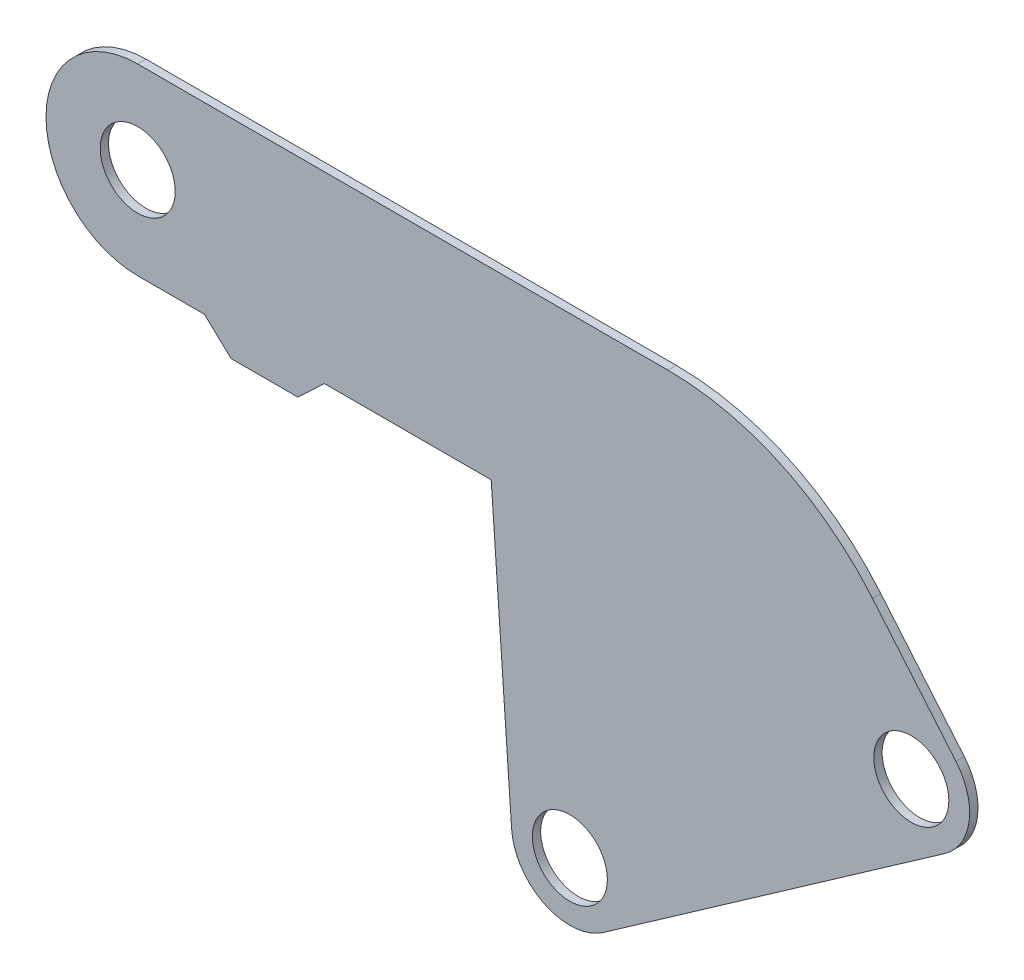
ISO-10303-21;
HEADER;
FILE_DESCRIPTION(('STEP AP214'),'2;1');
FILE_NAME('part.step','',(''),(''),'','','');
FILE_SCHEMA(('AUTOMOTIVE_DESIGN { 1 0 10303 214 1 1 1 1 }'));
ENDSEC;
DATA;
#1=APPLICATION_CONTEXT('core data for automotive mechanical design processes');
#2=APPLICATION_PROTOCOL_DEFINITION('international standard','automotive_design',2000,#1);
#3=PRODUCT_CONTEXT('',#1,'mechanical');
#4=PRODUCT('Part','Part','',(#3));
#5=PRODUCT_RELATED_PRODUCT_CATEGORY('part','',(#4));
#6=PRODUCT_DEFINITION_FORMATION('','',#4);
#7=PRODUCT_DEFINITION_CONTEXT('part definition',#1,'design');
#8=PRODUCT_DEFINITION('design','',#6,#7);
#9=PRODUCT_DEFINITION_SHAPE('','',#8);
#10=(LENGTH_UNIT() NAMED_UNIT(*) SI_UNIT(.MILLI.,.METRE.));
#11=(NAMED_UNIT(*) PLANE_ANGLE_UNIT() SI_UNIT($,.RADIAN.));
#12=(NAMED_UNIT(*) SI_UNIT($,.STERADIAN.) SOLID_ANGLE_UNIT());
#13=UNCERTAINTY_MEASURE_WITH_UNIT(LENGTH_MEASURE(1.E-05),#10,'distance_accuracy_value','');
#14=(GEOMETRIC_REPRESENTATION_CONTEXT(3) GLOBAL_UNCERTAINTY_ASSIGNED_CONTEXT((#13)) GLOBAL_UNIT_ASSIGNED_CONTEXT((#10,
#11,#12)) REPRESENTATION_CONTEXT('',''));
#15=CARTESIAN_POINT('',(0.,0.,0.));
#16=DIRECTION('',(0.,0.,1.));
#17=DIRECTION('',(1.,0.,0.));
#18=AXIS2_PLACEMENT_3D('',#15,#16,#17);
#19=CARTESIAN_POINT('',(164.572072720799,71.2488259804571,3.175));
#20=DIRECTION('',(0.,0.,1.));
#21=DIRECTION('',(1.,0.,0.));
#22=AXIS2_PLACEMENT_3D('',#19,#20,#21);
#23=PLANE('',#22);
#24=CARTESIAN_POINT('',(0.,215.9,3.175));
#25=DIRECTION('',(0.,0.,1.));
#26=DIRECTION('',(1.,0.,0.));
#27=AXIS2_PLACEMENT_3D('',#24,#25,#26);
#28=CIRCLE('',#27,14.2875);
#29=CARTESIAN_POINT('',(14.2875,215.9,3.175));
#30=VERTEX_POINT('',#29);
#31=EDGE_CURVE('E309',#30,#30,#28,.T.);
#32=ORIENTED_EDGE('',*,*,#31,.F.);
#33=EDGE_LOOP('',(#32));
#34=FACE_BOUND('',#33,.T.);
#35=CARTESIAN_POINT('',(164.572072720799,71.2488259804571,3.175));
#36=DIRECTION('',(0.,0.,1.));
#37=DIRECTION('',(1.,0.,0.));
#38=AXIS2_PLACEMENT_3D('',#35,#36,#37);
#39=CIRCLE('',#38,22.225);
#40=CARTESIAN_POINT('',(142.401211703775,69.698488351494,3.175));
#41=VERTEX_POINT('',#40);
#42=CARTESIAN_POINT('',(177.319809018701,53.0431717961343,3.175));
#43=VERTEX_POINT('',#42);
#44=EDGE_CURVE('E195',#41,#43,#39,.T.);
#45=ORIENTED_EDGE('',*,*,#44,.T.);
#46=DIRECTION('',(0.819152044288991,0.573576436351047,0.));
#47=VECTOR('',#46,1.);
#48=CARTESIAN_POINT('',(177.319809018701,53.0431717961343,3.175));
#49=LINE('',#48,#47);
#50=CARTESIAN_POINT('',(307.360196049579,144.098431066863,3.175));
#51=VERTEX_POINT('',#50);
#52=EDGE_CURVE('E118',#43,#51,#49,.T.);
#53=ORIENTED_EDGE('',*,*,#52,.T.);
#54=CARTESIAN_POINT('',(294.612459751677,162.304085251186,3.175));
#55=DIRECTION('',(0.,0.,1.));
#56=DIRECTION('',(-1.,0.,0.));
#57=AXIS2_PLACEMENT_3D('',#54,#55,#56);
#58=CIRCLE('',#57,22.225);
#59=CARTESIAN_POINT('',(311.637797499996,176.590039876469,3.175));
#60=VERTEX_POINT('',#59);
#61=EDGE_CURVE('E225',#51,#60,#58,.T.);
#62=ORIENTED_EDGE('',*,*,#61,.T.);
#63=DIRECTION('',(-0.642787609686537,0.76604444311898,0.));
#64=VECTOR('',#63,1.);
#65=CARTESIAN_POINT('',(279.800527192222,214.532221144152,3.175));
#66=LINE('',#65,#64);
#67=CARTESIAN_POINT('',(279.800527192222,214.532221144152,3.175));
#68=VERTEX_POINT('',#67);
#69=EDGE_CURVE('E244',#60,#68,#66,.T.);
#70=ORIENTED_EDGE('',*,*,#69,.T.);
#71=CARTESIAN_POINT('',(201.970411771333,149.225,3.175));
#72=DIRECTION('',(0.,0.,1.));
#73=DIRECTION('',(-1.,0.,0.));
#74=AXIS2_PLACEMENT_3D('',#71,#72,#73);
#75=CIRCLE('',#74,101.6);
#76=CARTESIAN_POINT('',(201.970411771333,250.825,3.175));
#77=VERTEX_POINT('',#76);
#78=EDGE_CURVE('E241',#68,#77,#75,.T.);
#79=ORIENTED_EDGE('',*,*,#78,.T.);
#80=DIRECTION('',(-1.,0.,0.));
#81=VECTOR('',#80,1.);
#82=CARTESIAN_POINT('',(0.,250.825,3.175));
#83=LINE('',#82,#81);
#84=CARTESIAN_POINT('',(0.,250.825,3.175));
#85=VERTEX_POINT('',#84);
#86=EDGE_CURVE('E243',#77,#85,#83,.T.);
#87=ORIENTED_EDGE('',*,*,#86,.T.);
#88=CARTESIAN_POINT('',(0.,215.9,3.175));
#89=DIRECTION('',(0.,0.,1.));
#90=DIRECTION('',(1.,0.,0.));
#91=AXIS2_PLACEMENT_3D('',#88,#89,#90);
#92=CIRCLE('',#91,34.925);
#93=CARTESIAN_POINT('',(0.,180.975,3.175));
#94=VERTEX_POINT('',#93);
#95=EDGE_CURVE('E246',#85,#94,#92,.T.);
#96=ORIENTED_EDGE('',*,*,#95,.T.);
#97=DIRECTION('',(1.,0.,0.));
#98=VECTOR('',#97,1.);
#99=CARTESIAN_POINT('',(0.,180.975,3.175));
#100=LINE('',#99,#98);
#101=CARTESIAN_POINT('',(25.4,180.975,3.175));
#102=VERTEX_POINT('',#101);
#103=EDGE_CURVE('E252',#94,#102,#100,.T.);
#104=ORIENTED_EDGE('',*,*,#103,.T.);
#105=DIRECTION('',(0.729537204140085,-0.68394112888133,0.));
#106=VECTOR('',#105,1.);
#107=CARTESIAN_POINT('',(25.4,180.975,3.175));
#108=LINE('',#107,#106);
#109=CARTESIAN_POINT('',(35.56,171.45,3.175));
#110=VERTEX_POINT('',#109);
#111=EDGE_CURVE('E254',#102,#110,#108,.T.);
#112=ORIENTED_EDGE('',*,*,#111,.T.);
#113=DIRECTION('',(1.,0.,0.));
#114=VECTOR('',#113,1.);
#115=CARTESIAN_POINT('',(35.56,171.45,3.175));
#116=LINE('',#115,#114);
#117=CARTESIAN_POINT('',(60.96,171.45,3.175));
#118=VERTEX_POINT('',#117);
#119=EDGE_CURVE('E152',#110,#118,#116,.T.);
#120=ORIENTED_EDGE('',*,*,#119,.T.);
#121=DIRECTION('',(0.729537204140086,0.683941128881329,0.));
#122=VECTOR('',#121,1.);
#123=CARTESIAN_POINT('',(60.96,171.45,3.175));
#124=LINE('',#123,#122);
#125=CARTESIAN_POINT('',(71.12,180.975,3.175));
#126=VERTEX_POINT('',#125);
#127=EDGE_CURVE('E146',#118,#126,#124,.T.);
#128=ORIENTED_EDGE('',*,*,#127,.T.);
#129=DIRECTION('',(1.,0.,0.));
#130=VECTOR('',#129,1.);
#131=CARTESIAN_POINT('',(71.12,180.975,3.175));
#132=LINE('',#131,#130);
#133=CARTESIAN_POINT('',(134.62,180.975,3.175));
#134=VERTEX_POINT('',#133);
#135=EDGE_CURVE('E150',#126,#134,#132,.T.);
#136=ORIENTED_EDGE('',*,*,#135,.T.);
#137=DIRECTION('',(0.0697564737441218,-0.997564050259824,0.));
#138=VECTOR('',#137,1.);
#139=CARTESIAN_POINT('',(134.62,180.975,3.175));
#140=LINE('',#139,#138);
#141=EDGE_CURVE('E60',#134,#41,#140,.T.);
#142=ORIENTED_EDGE('',*,*,#141,.T.);
#143=EDGE_LOOP('',(#45,#53,#62,#70,#79,#87,#96,#104,#112,#120,#128,#136,#142));
#144=FACE_BOUND('',#143,.T.);
#145=CARTESIAN_POINT('',(164.572072720799,71.2488259804571,3.175));
#146=DIRECTION('',(0.,0.,1.));
#147=DIRECTION('',(1.,0.,0.));
#148=AXIS2_PLACEMENT_3D('',#145,#146,#147);
#149=CIRCLE('',#148,14.2875);
#150=CARTESIAN_POINT('',(178.859572720799,71.2488259804571,3.175));
#151=VERTEX_POINT('',#150);
#152=EDGE_CURVE('E174',#151,#151,#149,.T.);
#153=ORIENTED_EDGE('',*,*,#152,.F.);
#154=EDGE_LOOP('',(#153));
#155=FACE_BOUND('',#154,.T.);
#156=CARTESIAN_POINT('',(294.612459751677,162.304085251186,3.175));
#157=DIRECTION('',(0.,0.,1.));
#158=DIRECTION('',(1.,0.,0.));
#159=AXIS2_PLACEMENT_3D('',#156,#157,#158);
#160=CIRCLE('',#159,14.2875);
#161=CARTESIAN_POINT('',(308.899959751677,162.304085251186,3.175));
#162=VERTEX_POINT('',#161);
#163=EDGE_CURVE('E300',#162,#162,#160,.T.);
#164=ORIENTED_EDGE('',*,*,#163,.F.);
#165=EDGE_LOOP('',(#164));
#166=FACE_BOUND('',#165,.T.);
#167=ADVANCED_FACE('F43',(#34,#144,#155,#166),#23,.T.);
#168=CARTESIAN_POINT('',(164.572072720799,71.2488259804571,0.));
#169=DIRECTION('',(0.,0.,1.));
#170=DIRECTION('',(1.,0.,0.));
#171=AXIS2_PLACEMENT_3D('',#168,#169,#170);
#172=PLANE('',#171);
#173=CARTESIAN_POINT('',(164.572072720799,71.2488259804571,0.));
#174=DIRECTION('',(0.,0.,1.));
#175=DIRECTION('',(1.,0.,0.));
#176=AXIS2_PLACEMENT_3D('',#173,#174,#175);
#177=CIRCLE('',#176,22.225);
#178=CARTESIAN_POINT('',(142.401211703775,69.698488351494,0.));
#179=VERTEX_POINT('',#178);
#180=CARTESIAN_POINT('',(177.319809018701,53.0431717961343,0.));
#181=VERTEX_POINT('',#180);
#182=EDGE_CURVE('E170',#179,#181,#177,.T.);
#183=ORIENTED_EDGE('',*,*,#182,.F.);
#184=DIRECTION('',(0.0697564737441218,-0.997564050259824,0.));
#185=VECTOR('',#184,1.);
#186=CARTESIAN_POINT('',(134.62,180.975,0.));
#187=LINE('',#186,#185);
#188=CARTESIAN_POINT('',(134.62,180.975,0.));
#189=VERTEX_POINT('',#188);
#190=EDGE_CURVE('E110',#189,#179,#187,.T.);
#191=ORIENTED_EDGE('',*,*,#190,.F.);
#192=DIRECTION('',(1.,0.,0.));
#193=VECTOR('',#192,1.);
#194=CARTESIAN_POINT('',(71.12,180.975,0.));
#195=LINE('',#194,#193);
#196=CARTESIAN_POINT('',(71.12,180.975,0.));
#197=VERTEX_POINT('',#196);
#198=EDGE_CURVE('E104',#197,#189,#195,.T.);
#199=ORIENTED_EDGE('',*,*,#198,.F.);
#200=DIRECTION('',(0.729537204140086,0.683941128881329,0.));
#201=VECTOR('',#200,1.);
#202=CARTESIAN_POINT('',(60.96,171.45,0.));
#203=LINE('',#202,#201);
#204=CARTESIAN_POINT('',(60.96,171.45,0.));
#205=VERTEX_POINT('',#204);
#206=EDGE_CURVE('E160',#205,#197,#203,.T.);
#207=ORIENTED_EDGE('',*,*,#206,.F.);
#208=DIRECTION('',(1.,0.,0.));
#209=VECTOR('',#208,1.);
#210=CARTESIAN_POINT('',(35.56,171.45,0.));
#211=LINE('',#210,#209);
#212=CARTESIAN_POINT('',(35.56,171.45,0.));
#213=VERTEX_POINT('',#212);
#214=EDGE_CURVE('E190',#213,#205,#211,.T.);
#215=ORIENTED_EDGE('',*,*,#214,.F.);
#216=DIRECTION('',(0.729537204140085,-0.68394112888133,0.));
#217=VECTOR('',#216,1.);
#218=CARTESIAN_POINT('',(25.4,180.975,0.));
#219=LINE('',#218,#217);
#220=CARTESIAN_POINT('',(25.4,180.975,0.));
#221=VERTEX_POINT('',#220);
#222=EDGE_CURVE('E188',#221,#213,#219,.T.);
#223=ORIENTED_EDGE('',*,*,#222,.F.);
#224=DIRECTION('',(1.,0.,0.));
#225=VECTOR('',#224,1.);
#226=CARTESIAN_POINT('',(0.,180.975,0.));
#227=LINE('',#226,#225);
#228=CARTESIAN_POINT('',(0.,180.975,0.));
#229=VERTEX_POINT('',#228);
#230=EDGE_CURVE('E186',#229,#221,#227,.T.);
#231=ORIENTED_EDGE('',*,*,#230,.F.);
#232=CARTESIAN_POINT('',(0.,215.9,0.));
#233=DIRECTION('',(0.,0.,1.));
#234=DIRECTION('',(1.,0.,0.));
#235=AXIS2_PLACEMENT_3D('',#232,#233,#234);
#236=CIRCLE('',#235,34.925);
#237=CARTESIAN_POINT('',(0.,250.825,0.));
#238=VERTEX_POINT('',#237);
#239=EDGE_CURVE('E184',#238,#229,#236,.T.);
#240=ORIENTED_EDGE('',*,*,#239,.F.);
#241=DIRECTION('',(-1.,0.,0.));
#242=VECTOR('',#241,1.);
#243=CARTESIAN_POINT('',(0.,250.825,0.));
#244=LINE('',#243,#242);
#245=CARTESIAN_POINT('',(201.970411771333,250.825,0.));
#246=VERTEX_POINT('',#245);
#247=EDGE_CURVE('E182',#246,#238,#244,.T.);
#248=ORIENTED_EDGE('',*,*,#247,.F.);
#249=CARTESIAN_POINT('',(201.970411771333,149.225,0.));
#250=DIRECTION('',(0.,0.,1.));
#251=DIRECTION('',(-1.,0.,0.));
#252=AXIS2_PLACEMENT_3D('',#249,#250,#251);
#253=CIRCLE('',#252,101.6);
#254=CARTESIAN_POINT('',(279.800527192222,214.532221144152,0.));
#255=VERTEX_POINT('',#254);
#256=EDGE_CURVE('E180',#255,#246,#253,.T.);
#257=ORIENTED_EDGE('',*,*,#256,.F.);
#258=DIRECTION('',(-0.642787609686537,0.76604444311898,0.));
#259=VECTOR('',#258,1.);
#260=CARTESIAN_POINT('',(279.800527192222,214.532221144152,0.));
#261=LINE('',#260,#259);
#262=CARTESIAN_POINT('',(311.637797499996,176.590039876469,0.));
#263=VERTEX_POINT('',#262);
#264=EDGE_CURVE('E178',#263,#255,#261,.T.);
#265=ORIENTED_EDGE('',*,*,#264,.F.);
#266=CARTESIAN_POINT('',(294.612459751677,162.304085251186,0.));
#267=DIRECTION('',(0.,0.,1.));
#268=DIRECTION('',(-1.,0.,0.));
#269=AXIS2_PLACEMENT_3D('',#266,#267,#268);
#270=CIRCLE('',#269,22.225);
#271=CARTESIAN_POINT('',(307.360196049579,144.098431066863,0.));
#272=VERTEX_POINT('',#271);
#273=EDGE_CURVE('E176',#272,#263,#270,.T.);
#274=ORIENTED_EDGE('',*,*,#273,.F.);
#275=DIRECTION('',(0.819152044288991,0.573576436351047,0.));
#276=VECTOR('',#275,1.);
#277=CARTESIAN_POINT('',(177.319809018701,53.0431717961343,0.));
#278=LINE('',#277,#276);
#279=EDGE_CURVE('E173',#181,#272,#278,.T.);
#280=ORIENTED_EDGE('',*,*,#279,.F.);
#281=EDGE_LOOP('',(#183,#191,#199,#207,#215,#223,#231,#240,#248,#257,#265,#274,#280));
#282=FACE_BOUND('',#281,.T.);
#283=CARTESIAN_POINT('',(164.572072720799,71.2488259804571,0.));
#284=DIRECTION('',(0.,0.,1.));
#285=DIRECTION('',(1.,0.,0.));
#286=AXIS2_PLACEMENT_3D('',#283,#284,#285);
#287=CIRCLE('',#286,14.2875);
#288=CARTESIAN_POINT('',(178.859572720799,71.2488259804571,0.));
#289=VERTEX_POINT('',#288);
#290=EDGE_CURVE('E312',#289,#289,#287,.T.);
#291=ORIENTED_EDGE('',*,*,#290,.T.);
#292=EDGE_LOOP('',(#291));
#293=FACE_BOUND('',#292,.T.);
#294=CARTESIAN_POINT('',(0.,215.9,0.));
#295=DIRECTION('',(0.,0.,1.));
#296=DIRECTION('',(1.,0.,0.));
#297=AXIS2_PLACEMENT_3D('',#294,#295,#296);
#298=CIRCLE('',#297,14.2875);
#299=CARTESIAN_POINT('',(14.2875,215.9,0.));
#300=VERTEX_POINT('',#299);
#301=EDGE_CURVE('E306',#300,#300,#298,.T.);
#302=ORIENTED_EDGE('',*,*,#301,.T.);
#303=EDGE_LOOP('',(#302));
#304=FACE_BOUND('',#303,.T.);
#305=CARTESIAN_POINT('',(294.612459751677,162.304085251186,0.));
#306=DIRECTION('',(0.,0.,1.));
#307=DIRECTION('',(1.,0.,0.));
#308=AXIS2_PLACEMENT_3D('',#305,#306,#307);
#309=CIRCLE('',#308,14.2875);
#310=CARTESIAN_POINT('',(308.899959751677,162.304085251186,0.));
#311=VERTEX_POINT('',#310);
#312=EDGE_CURVE('E303',#311,#311,#309,.T.);
#313=ORIENTED_EDGE('',*,*,#312,.T.);
#314=EDGE_LOOP('',(#313));
#315=FACE_BOUND('',#314,.T.);
#316=ADVANCED_FACE('F229',(#282,#293,#304,#315),#172,.F.);
#317=CARTESIAN_POINT('',(164.572072720799,71.2488259804571,3.175));
#318=DIRECTION('',(0.,0.,-1.));
#319=DIRECTION('',(-1.,0.,0.));
#320=AXIS2_PLACEMENT_3D('',#317,#318,#319);
#321=CYLINDRICAL_SURFACE('',#320,22.225);
#322=ORIENTED_EDGE('',*,*,#182,.T.);
#323=DIRECTION('',(0.,0.,-1.));
#324=VECTOR('',#323,1.);
#325=CARTESIAN_POINT('',(177.319809018701,53.0431717961343,3.175));
#326=LINE('',#325,#324);
#327=EDGE_CURVE('E11',#43,#181,#326,.T.);
#328=ORIENTED_EDGE('',*,*,#327,.F.);
#329=ORIENTED_EDGE('',*,*,#44,.F.);
#330=DIRECTION('',(0.,0.,-1.));
#331=VECTOR('',#330,1.);
#332=CARTESIAN_POINT('',(142.401211703775,69.698488351494,3.175));
#333=LINE('',#332,#331);
#334=EDGE_CURVE('E166',#41,#179,#333,.T.);
#335=ORIENTED_EDGE('',*,*,#334,.T.);
#336=EDGE_LOOP('',(#322,#328,#329,#335));
#337=FACE_BOUND('',#336,.T.);
#338=ADVANCED_FACE('F45',(#337),#321,.T.);
#339=CARTESIAN_POINT('',(177.319809018701,53.0431717961343,3.175));
#340=DIRECTION('',(-0.573576436351047,0.819152044288991,0.));
#341=DIRECTION('',(-0.819152044288991,-0.573576436351047,0.));
#342=AXIS2_PLACEMENT_3D('',#339,#340,#341);
#343=PLANE('',#342);
#344=ORIENTED_EDGE('',*,*,#279,.T.);
#345=DIRECTION('',(0.,0.,-1.));
#346=VECTOR('',#345,1.);
#347=CARTESIAN_POINT('',(307.360196049579,144.098431066863,3.175));
#348=LINE('',#347,#346);
#349=EDGE_CURVE('E52',#51,#272,#348,.T.);
#350=ORIENTED_EDGE('',*,*,#349,.F.);
#351=ORIENTED_EDGE('',*,*,#52,.F.);
#352=ORIENTED_EDGE('',*,*,#327,.T.);
#353=EDGE_LOOP('',(#344,#350,#351,#352));
#354=FACE_BOUND('',#353,.T.);
#355=ADVANCED_FACE('F427',(#354),#343,.F.);
#356=CARTESIAN_POINT('',(294.612459751677,162.304085251186,3.175));
#357=DIRECTION('',(0.,0.,-1.));
#358=DIRECTION('',(-1.,0.,0.));
#359=AXIS2_PLACEMENT_3D('',#356,#357,#358);
#360=CYLINDRICAL_SURFACE('',#359,22.225);
#361=ORIENTED_EDGE('',*,*,#273,.T.);
#362=DIRECTION('',(0.,0.,-1.));
#363=VECTOR('',#362,1.);
#364=CARTESIAN_POINT('',(311.637797499996,176.590039876469,3.175));
#365=LINE('',#364,#363);
#366=EDGE_CURVE('E217',#60,#263,#365,.T.);
#367=ORIENTED_EDGE('',*,*,#366,.F.);
#368=ORIENTED_EDGE('',*,*,#61,.F.);
#369=ORIENTED_EDGE('',*,*,#349,.T.);
#370=EDGE_LOOP('',(#361,#367,#368,#369));
#371=FACE_BOUND('',#370,.T.);
#372=ADVANCED_FACE('F223',(#371),#360,.T.);
#373=CARTESIAN_POINT('',(279.800527192222,214.532221144152,3.175));
#374=DIRECTION('',(-0.76604444311898,-0.642787609686537,0.));
#375=DIRECTION('',(0.642787609686537,-0.76604444311898,0.));
#376=AXIS2_PLACEMENT_3D('',#373,#374,#375);
#377=PLANE('',#376);
#378=ORIENTED_EDGE('',*,*,#264,.T.);
#379=DIRECTION('',(0.,0.,-1.));
#380=VECTOR('',#379,1.);
#381=CARTESIAN_POINT('',(279.800527192222,214.532221144152,3.175));
#382=LINE('',#381,#380);
#383=EDGE_CURVE('E214',#68,#255,#382,.T.);
#384=ORIENTED_EDGE('',*,*,#383,.F.);
#385=ORIENTED_EDGE('',*,*,#69,.F.);
#386=ORIENTED_EDGE('',*,*,#366,.T.);
#387=EDGE_LOOP('',(#378,#384,#385,#386));
#388=FACE_BOUND('',#387,.T.);
#389=ADVANCED_FACE('F235',(#388),#377,.F.);
#390=CARTESIAN_POINT('',(201.970411771333,149.225,3.175));
#391=DIRECTION('',(0.,0.,-1.));
#392=DIRECTION('',(-1.,0.,0.));
#393=AXIS2_PLACEMENT_3D('',#390,#391,#392);
#394=CYLINDRICAL_SURFACE('',#393,101.6);
#395=ORIENTED_EDGE('',*,*,#256,.T.);
#396=DIRECTION('',(0.,0.,-1.));
#397=VECTOR('',#396,1.);
#398=CARTESIAN_POINT('',(201.970411771333,250.825,3.175));
#399=LINE('',#398,#397);
#400=EDGE_CURVE('E211',#77,#246,#399,.T.);
#401=ORIENTED_EDGE('',*,*,#400,.F.);
#402=ORIENTED_EDGE('',*,*,#78,.F.);
#403=ORIENTED_EDGE('',*,*,#383,.T.);
#404=EDGE_LOOP('',(#395,#401,#402,#403));
#405=FACE_BOUND('',#404,.T.);
#406=ADVANCED_FACE('F239',(#405),#394,.T.);
#407=CARTESIAN_POINT('',(0.,250.825,3.175));
#408=DIRECTION('',(0.,-1.,0.));
#409=DIRECTION('',(1.,0.,0.));
#410=AXIS2_PLACEMENT_3D('',#407,#408,#409);
#411=PLANE('',#410);
#412=ORIENTED_EDGE('',*,*,#247,.T.);
#413=DIRECTION('',(0.,0.,-1.));
#414=VECTOR('',#413,1.);
#415=CARTESIAN_POINT('',(0.,250.825,3.175));
#416=LINE('',#415,#414);
#417=EDGE_CURVE('E208',#85,#238,#416,.T.);
#418=ORIENTED_EDGE('',*,*,#417,.F.);
#419=ORIENTED_EDGE('',*,*,#86,.F.);
#420=ORIENTED_EDGE('',*,*,#400,.T.);
#421=EDGE_LOOP('',(#412,#418,#419,#420));
#422=FACE_BOUND('',#421,.T.);
#423=ADVANCED_FACE('F392',(#422),#411,.F.);
#424=CARTESIAN_POINT('',(0.,215.9,3.175));
#425=DIRECTION('',(0.,0.,-1.));
#426=DIRECTION('',(-1.,0.,0.));
#427=AXIS2_PLACEMENT_3D('',#424,#425,#426);
#428=CYLINDRICAL_SURFACE('',#427,34.925);
#429=ORIENTED_EDGE('',*,*,#239,.T.);
#430=DIRECTION('',(0.,0.,-1.));
#431=VECTOR('',#430,1.);
#432=CARTESIAN_POINT('',(0.,180.975,3.175));
#433=LINE('',#432,#431);
#434=EDGE_CURVE('E205',#94,#229,#433,.T.);
#435=ORIENTED_EDGE('',*,*,#434,.F.);
#436=ORIENTED_EDGE('',*,*,#95,.F.);
#437=ORIENTED_EDGE('',*,*,#417,.T.);
#438=EDGE_LOOP('',(#429,#435,#436,#437));
#439=FACE_BOUND('',#438,.T.);
#440=ADVANCED_FACE('F382',(#439),#428,.T.);
#441=CARTESIAN_POINT('',(0.,180.975,3.175));
#442=DIRECTION('',(0.,1.,0.));
#443=DIRECTION('',(-1.,0.,0.));
#444=AXIS2_PLACEMENT_3D('',#441,#442,#443);
#445=PLANE('',#444);
#446=ORIENTED_EDGE('',*,*,#230,.T.);
#447=DIRECTION('',(0.,0.,-1.));
#448=VECTOR('',#447,1.);
#449=CARTESIAN_POINT('',(25.4,180.975,3.175));
#450=LINE('',#449,#448);
#451=EDGE_CURVE('E202',#102,#221,#450,.T.);
#452=ORIENTED_EDGE('',*,*,#451,.F.);
#453=ORIENTED_EDGE('',*,*,#103,.F.);
#454=ORIENTED_EDGE('',*,*,#434,.T.);
#455=EDGE_LOOP('',(#446,#452,#453,#454));
#456=FACE_BOUND('',#455,.T.);
#457=ADVANCED_FACE('F373',(#456),#445,.F.);
#458=CARTESIAN_POINT('',(25.4,180.975,3.175));
#459=DIRECTION('',(0.68394112888133,0.729537204140085,0.));
#460=DIRECTION('',(-0.729537204140085,0.68394112888133,0.));
#461=AXIS2_PLACEMENT_3D('',#458,#459,#460);
#462=PLANE('',#461);
#463=ORIENTED_EDGE('',*,*,#222,.T.);
#464=DIRECTION('',(0.,0.,-1.));
#465=VECTOR('',#464,1.);
#466=CARTESIAN_POINT('',(35.56,171.45,3.175));
#467=LINE('',#466,#465);
#468=EDGE_CURVE('E199',#110,#213,#467,.T.);
#469=ORIENTED_EDGE('',*,*,#468,.F.);
#470=ORIENTED_EDGE('',*,*,#111,.F.);
#471=ORIENTED_EDGE('',*,*,#451,.T.);
#472=EDGE_LOOP('',(#463,#469,#470,#471));
#473=FACE_BOUND('',#472,.T.);
#474=ADVANCED_FACE('F260',(#473),#462,.F.);
#475=CARTESIAN_POINT('',(35.56,171.45,3.175));
#476=DIRECTION('',(0.,1.,0.));
#477=DIRECTION('',(0.,0.,1.));
#478=AXIS2_PLACEMENT_3D('',#475,#476,#477);
#479=PLANE('',#478);
#480=ORIENTED_EDGE('',*,*,#214,.T.);
#481=DIRECTION('',(0.,0.,-1.));
#482=VECTOR('',#481,1.);
#483=CARTESIAN_POINT('',(60.96,171.45,3.175));
#484=LINE('',#483,#482);
#485=EDGE_CURVE('E161',#118,#205,#484,.T.);
#486=ORIENTED_EDGE('',*,*,#485,.F.);
#487=ORIENTED_EDGE('',*,*,#119,.F.);
#488=ORIENTED_EDGE('',*,*,#468,.T.);
#489=EDGE_LOOP('',(#480,#486,#487,#488));
#490=FACE_BOUND('',#489,.T.);
#491=ADVANCED_FACE('F264',(#490),#479,.F.);
#492=CARTESIAN_POINT('',(60.96,171.45,3.175));
#493=DIRECTION('',(-0.683941128881329,0.729537204140086,0.));
#494=DIRECTION('',(-0.729537204140086,-0.683941128881329,0.));
#495=AXIS2_PLACEMENT_3D('',#492,#493,#494);
#496=PLANE('',#495);
#497=ORIENTED_EDGE('',*,*,#206,.T.);
#498=DIRECTION('',(0.,0.,-1.));
#499=VECTOR('',#498,1.);
#500=CARTESIAN_POINT('',(71.12,180.975,3.175));
#501=LINE('',#500,#499);
#502=EDGE_CURVE('E157',#126,#197,#501,.T.);
#503=ORIENTED_EDGE('',*,*,#502,.F.);
#504=ORIENTED_EDGE('',*,*,#127,.F.);
#505=ORIENTED_EDGE('',*,*,#485,.T.);
#506=EDGE_LOOP('',(#497,#503,#504,#505));
#507=FACE_BOUND('',#506,.T.);
#508=ADVANCED_FACE('F158',(#507),#496,.F.);
#509=CARTESIAN_POINT('',(71.12,180.975,3.175));
#510=DIRECTION('',(0.,1.,0.));
#511=DIRECTION('',(-1.,0.,0.));
#512=AXIS2_PLACEMENT_3D('',#509,#510,#511);
#513=PLANE('',#512);
#514=ORIENTED_EDGE('',*,*,#198,.T.);
#515=DIRECTION('',(0.,0.,-1.));
#516=VECTOR('',#515,1.);
#517=CARTESIAN_POINT('',(134.62,180.975,3.175));
#518=LINE('',#517,#516);
#519=EDGE_CURVE('E162',#134,#189,#518,.T.);
#520=ORIENTED_EDGE('',*,*,#519,.F.);
#521=ORIENTED_EDGE('',*,*,#135,.F.);
#522=ORIENTED_EDGE('',*,*,#502,.T.);
#523=EDGE_LOOP('',(#514,#520,#521,#522));
#524=FACE_BOUND('',#523,.T.);
#525=ADVANCED_FACE('F164',(#524),#513,.F.);
#526=CARTESIAN_POINT('',(134.62,180.975,3.175));
#527=DIRECTION('',(0.997564050259825,0.0697564737441218,0.));
#528=DIRECTION('',(-0.0697564737441218,0.997564050259825,0.));
#529=AXIS2_PLACEMENT_3D('',#526,#527,#528);
#530=PLANE('',#529);
#531=ORIENTED_EDGE('',*,*,#190,.T.);
#532=ORIENTED_EDGE('',*,*,#334,.F.);
#533=ORIENTED_EDGE('',*,*,#141,.F.);
#534=ORIENTED_EDGE('',*,*,#519,.T.);
#535=EDGE_LOOP('',(#531,#532,#533,#534));
#536=FACE_BOUND('',#535,.T.);
#537=ADVANCED_FACE('F268',(#536),#530,.F.);
#538=CARTESIAN_POINT('',(164.572072720799,71.2488259804571,3.175));
#539=DIRECTION('',(0.,0.,-1.));
#540=DIRECTION('',(-1.,0.,0.));
#541=AXIS2_PLACEMENT_3D('',#538,#539,#540);
#542=CYLINDRICAL_SURFACE('',#541,14.2875);
#543=ORIENTED_EDGE('',*,*,#152,.T.);
#544=EDGE_LOOP('',(#543));
#545=FACE_BOUND('',#544,.T.);
#546=ORIENTED_EDGE('',*,*,#290,.F.);
#547=EDGE_LOOP('',(#546));
#548=FACE_BOUND('',#547,.T.);
#549=ADVANCED_FACE('F270',(#545,#548),#542,.F.);
#550=CARTESIAN_POINT('',(0.,215.9,3.175));
#551=DIRECTION('',(0.,0.,-1.));
#552=DIRECTION('',(-1.,0.,0.));
#553=AXIS2_PLACEMENT_3D('',#550,#551,#552);
#554=CYLINDRICAL_SURFACE('',#553,14.2875);
#555=ORIENTED_EDGE('',*,*,#31,.T.);
#556=EDGE_LOOP('',(#555));
#557=FACE_BOUND('',#556,.T.);
#558=ORIENTED_EDGE('',*,*,#301,.F.);
#559=EDGE_LOOP('',(#558));
#560=FACE_BOUND('',#559,.T.);
#561=ADVANCED_FACE('F276',(#557,#560),#554,.F.);
#562=CARTESIAN_POINT('',(294.612459751677,162.304085251186,3.175));
#563=DIRECTION('',(0.,0.,-1.));
#564=DIRECTION('',(-1.,0.,0.));
#565=AXIS2_PLACEMENT_3D('',#562,#563,#564);
#566=CYLINDRICAL_SURFACE('',#565,14.2875);
#567=ORIENTED_EDGE('',*,*,#163,.T.);
#568=EDGE_LOOP('',(#567));
#569=FACE_BOUND('',#568,.T.);
#570=ORIENTED_EDGE('',*,*,#312,.F.);
#571=EDGE_LOOP('',(#570));
#572=FACE_BOUND('',#571,.T.);
#573=ADVANCED_FACE('F291',(#569,#572),#566,.F.);
#574=CLOSED_SHELL('',(#167,#316,#338,#355,#372,#389,#406,#423,#440,#457,#474,#491,#508,#525,
#537,#549,#561,#573));
#575=MANIFOLD_SOLID_BREP('B2',#574);
#576=ADVANCED_BREP_SHAPE_REPRESENTATION('',(#18,#575),#14);
#577=SHAPE_DEFINITION_REPRESENTATION(#9,#576);
ENDSEC;
END-ISO-10303-21;
